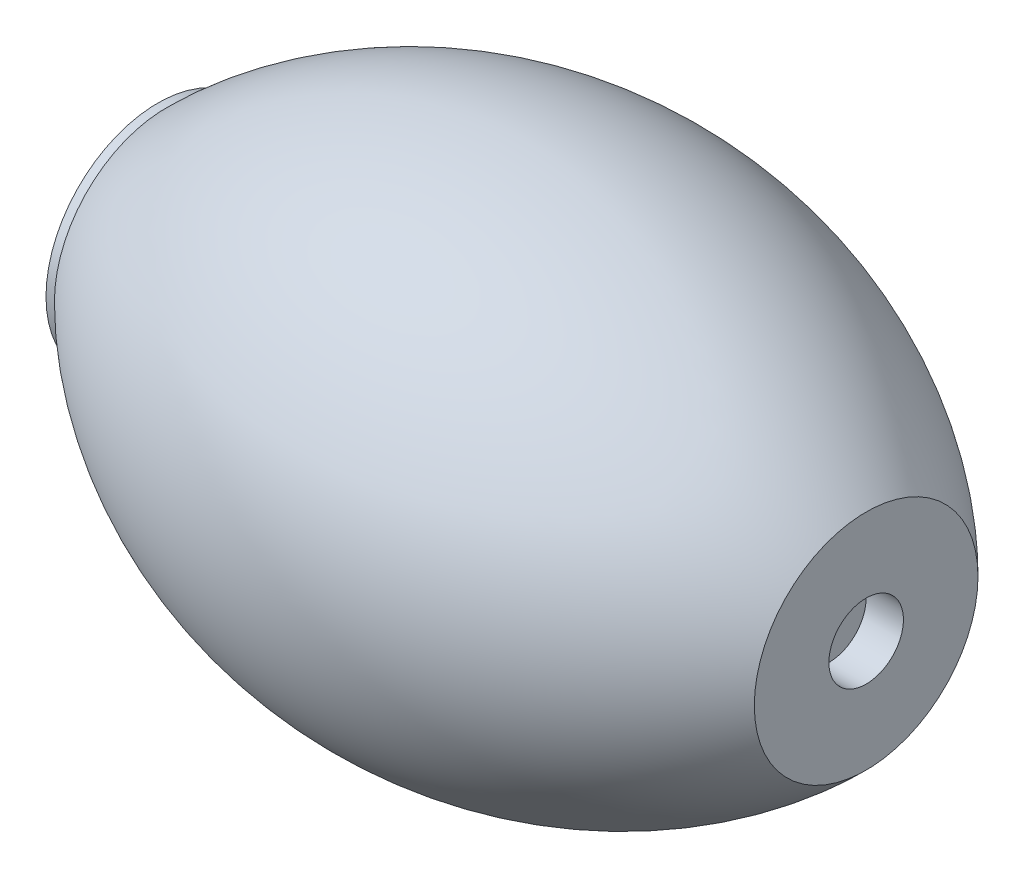
ISO-10303-21;
HEADER;
FILE_DESCRIPTION(('STEP AP214'),'2;1');
FILE_NAME('part.step','',(''),(''),'','','');
FILE_SCHEMA(('AUTOMOTIVE_DESIGN { 1 0 10303 214 1 1 1 1 }'));
ENDSEC;
DATA;
#1=APPLICATION_CONTEXT('core data for automotive mechanical design processes');
#2=APPLICATION_PROTOCOL_DEFINITION('international standard','automotive_design',2000,#1);
#3=PRODUCT_CONTEXT('',#1,'mechanical');
#4=PRODUCT('Part','Part','',(#3));
#5=PRODUCT_RELATED_PRODUCT_CATEGORY('part','',(#4));
#6=PRODUCT_DEFINITION_FORMATION('','',#4);
#7=PRODUCT_DEFINITION_CONTEXT('part definition',#1,'design');
#8=PRODUCT_DEFINITION('design','',#6,#7);
#9=PRODUCT_DEFINITION_SHAPE('','',#8);
#10=(LENGTH_UNIT() NAMED_UNIT(*) SI_UNIT(.MILLI.,.METRE.));
#11=(NAMED_UNIT(*) PLANE_ANGLE_UNIT() SI_UNIT($,.RADIAN.));
#12=(NAMED_UNIT(*) SI_UNIT($,.STERADIAN.) SOLID_ANGLE_UNIT());
#13=UNCERTAINTY_MEASURE_WITH_UNIT(LENGTH_MEASURE(1.E-05),#10,'distance_accuracy_value','');
#14=(GEOMETRIC_REPRESENTATION_CONTEXT(3) GLOBAL_UNCERTAINTY_ASSIGNED_CONTEXT((#13)) GLOBAL_UNIT_ASSIGNED_CONTEXT((#10,
#11,#12)) REPRESENTATION_CONTEXT('',''));
#15=CARTESIAN_POINT('',(0.,0.,0.));
#16=DIRECTION('',(0.,0.,1.));
#17=DIRECTION('',(1.,0.,0.));
#18=AXIS2_PLACEMENT_3D('',#15,#16,#17);
#19=CARTESIAN_POINT('',(-238.434509563249,-76.2,0.));
#20=DIRECTION('',(-1.,0.,0.));
#21=DIRECTION('',(0.,0.,1.));
#22=AXIS2_PLACEMENT_3D('',#19,#20,#21);
#23=DEGENERATE_TOROIDAL_SURFACE('',#22,162.234509563249,337.197317162125,.F.);
#24=CARTESIAN_POINT('',(-476.869019126499,-76.2000000000001,0.));
#25=DIRECTION('',(-1.,0.,0.));
#26=DIRECTION('',(0.,0.,1.));
#27=AXIS2_PLACEMENT_3D('',#24,#25,#26);
#28=CIRCLE('',#27,76.2);
#29=CARTESIAN_POINT('',(-476.869019126499,-76.2000000000001,76.2));
#30=VERTEX_POINT('',#29);
#31=EDGE_CURVE('E62',#30,#30,#28,.T.);
#32=ORIENTED_EDGE('',*,*,#31,.F.);
#33=EDGE_LOOP('',(#32));
#34=FACE_BOUND('',#33,.T.);
#35=CARTESIAN_POINT('',(0.,-76.2000000000001,0.));
#36=DIRECTION('',(-1.,0.,0.));
#37=DIRECTION('',(0.,0.,1.));
#38=AXIS2_PLACEMENT_3D('',#35,#36,#37);
#39=CIRCLE('',#38,76.2000000000001);
#40=CARTESIAN_POINT('',(0.,-76.2000000000001,76.2000000000001));
#41=VERTEX_POINT('',#40);
#42=EDGE_CURVE('E10',#41,#41,#39,.T.);
#43=ORIENTED_EDGE('',*,*,#42,.T.);
#44=EDGE_LOOP('',(#43));
#45=FACE_BOUND('',#44,.T.);
#46=ADVANCED_FACE('F37',(#34,#45),#23,.F.);
#47=CARTESIAN_POINT('',(0.,0.,0.));
#48=DIRECTION('',(-1.,0.,0.));
#49=DIRECTION('',(0.,0.,1.));
#50=AXIS2_PLACEMENT_3D('',#47,#48,#49);
#51=PLANE('',#50);
#52=ORIENTED_EDGE('',*,*,#42,.F.);
#53=EDGE_LOOP('',(#52));
#54=FACE_BOUND('',#53,.T.);
#55=CARTESIAN_POINT('',(1.11022302462516E-13,-76.2000000000001,0.));
#56=DIRECTION('',(-1.,0.,0.));
#57=DIRECTION('',(0.,0.,1.));
#58=AXIS2_PLACEMENT_3D('',#55,#56,#57);
#59=CIRCLE('',#58,25.4);
#60=CARTESIAN_POINT('',(1.11022302462516E-13,-76.2000000000001,25.4));
#61=VERTEX_POINT('',#60);
#62=EDGE_CURVE('E43',#61,#61,#59,.T.);
#63=ORIENTED_EDGE('',*,*,#62,.T.);
#64=EDGE_LOOP('',(#63));
#65=FACE_BOUND('',#64,.T.);
#66=ADVANCED_FACE('F69',(#54,#65),#51,.F.);
#67=CARTESIAN_POINT('',(-457.2,-76.2000000000001,0.));
#68=DIRECTION('',(-1.,0.,0.));
#69=DIRECTION('',(0.,0.,1.));
#70=AXIS2_PLACEMENT_3D('',#67,#68,#69);
#71=CYLINDRICAL_SURFACE('',#70,25.4);
#72=ORIENTED_EDGE('',*,*,#62,.F.);
#73=EDGE_LOOP('',(#72));
#74=FACE_BOUND('',#73,.T.);
#75=CARTESIAN_POINT('',(-25.3999999999999,-76.2000000000001,0.));
#76=DIRECTION('',(-1.,0.,0.));
#77=DIRECTION('',(0.,0.,1.));
#78=AXIS2_PLACEMENT_3D('',#75,#76,#77);
#79=CIRCLE('',#78,25.4);
#80=CARTESIAN_POINT('',(-25.3999999999999,-76.2000000000001,25.4));
#81=VERTEX_POINT('',#80);
#82=EDGE_CURVE('E47',#81,#81,#79,.T.);
#83=ORIENTED_EDGE('',*,*,#82,.T.);
#84=EDGE_LOOP('',(#83));
#85=FACE_BOUND('',#84,.T.);
#86=ADVANCED_FACE('F73',(#74,#85),#71,.F.);
#87=CARTESIAN_POINT('',(-25.3999999999999,-50.8000000000001,0.));
#88=DIRECTION('',(-1.,0.,0.));
#89=DIRECTION('',(0.,0.,1.));
#90=AXIS2_PLACEMENT_3D('',#87,#88,#89);
#91=PLANE('',#90);
#92=ORIENTED_EDGE('',*,*,#82,.F.);
#93=EDGE_LOOP('',(#92));
#94=FACE_BOUND('',#93,.T.);
#95=ADVANCED_FACE('F78',(#94),#91,.F.);
#96=CARTESIAN_POINT('',(-457.2,-50.8000000000001,0.));
#97=DIRECTION('',(1.,0.,0.));
#98=DIRECTION('',(0.,0.,-1.));
#99=AXIS2_PLACEMENT_3D('',#96,#97,#98);
#100=PLANE('',#99);
#101=CARTESIAN_POINT('',(-457.2,-76.2000000000001,0.));
#102=DIRECTION('',(-1.,0.,0.));
#103=DIRECTION('',(0.,0.,1.));
#104=AXIS2_PLACEMENT_3D('',#101,#102,#103);
#105=CIRCLE('',#104,25.4);
#106=CARTESIAN_POINT('',(-457.2,-76.2000000000001,25.4));
#107=VERTEX_POINT('',#106);
#108=EDGE_CURVE('E51',#107,#107,#105,.T.);
#109=ORIENTED_EDGE('',*,*,#108,.T.);
#110=EDGE_LOOP('',(#109));
#111=FACE_BOUND('',#110,.T.);
#112=ADVANCED_FACE('F84',(#111),#100,.F.);
#113=CARTESIAN_POINT('',(-457.2,-76.2000000000001,0.));
#114=DIRECTION('',(-1.,0.,0.));
#115=DIRECTION('',(0.,0.,1.));
#116=AXIS2_PLACEMENT_3D('',#113,#114,#115);
#117=CYLINDRICAL_SURFACE('',#116,25.4);
#118=ORIENTED_EDGE('',*,*,#108,.F.);
#119=EDGE_LOOP('',(#118));
#120=FACE_BOUND('',#119,.T.);
#121=CARTESIAN_POINT('',(-482.6,-76.2000000000001,0.));
#122=DIRECTION('',(-1.,0.,0.));
#123=DIRECTION('',(0.,0.,1.));
#124=AXIS2_PLACEMENT_3D('',#121,#122,#123);
#125=CIRCLE('',#124,25.4);
#126=CARTESIAN_POINT('',(-482.6,-76.2000000000001,25.4));
#127=VERTEX_POINT('',#126);
#128=EDGE_CURVE('E56',#127,#127,#125,.T.);
#129=ORIENTED_EDGE('',*,*,#128,.T.);
#130=EDGE_LOOP('',(#129));
#131=FACE_BOUND('',#130,.T.);
#132=ADVANCED_FACE('F88',(#120,#131),#117,.F.);
#133=CARTESIAN_POINT('',(-482.6,0.,0.));
#134=DIRECTION('',(1.,0.,0.));
#135=DIRECTION('',(0.,0.,-1.));
#136=AXIS2_PLACEMENT_3D('',#133,#134,#135);
#137=PLANE('',#136);
#138=ORIENTED_EDGE('',*,*,#128,.F.);
#139=EDGE_LOOP('',(#138));
#140=FACE_BOUND('',#139,.T.);
#141=CARTESIAN_POINT('',(-482.6,-76.2000000000001,0.));
#142=DIRECTION('',(-1.,0.,0.));
#143=DIRECTION('',(0.,0.,1.));
#144=AXIS2_PLACEMENT_3D('',#141,#142,#143);
#145=CIRCLE('',#144,76.2);
#146=CARTESIAN_POINT('',(-482.6,-76.2000000000001,76.2));
#147=VERTEX_POINT('',#146);
#148=EDGE_CURVE('E59',#147,#147,#145,.T.);
#149=ORIENTED_EDGE('',*,*,#148,.T.);
#150=EDGE_LOOP('',(#149));
#151=FACE_BOUND('',#150,.T.);
#152=ADVANCED_FACE('F92',(#140,#151),#137,.F.);
#153=CARTESIAN_POINT('',(-457.2,-76.2000000000001,0.));
#154=DIRECTION('',(-1.,0.,0.));
#155=DIRECTION('',(0.,0.,1.));
#156=AXIS2_PLACEMENT_3D('',#153,#154,#155);
#157=CYLINDRICAL_SURFACE('',#156,76.2);
#158=ORIENTED_EDGE('',*,*,#148,.F.);
#159=EDGE_LOOP('',(#158));
#160=FACE_BOUND('',#159,.T.);
#161=ORIENTED_EDGE('',*,*,#31,.T.);
#162=EDGE_LOOP('',(#161));
#163=FACE_BOUND('',#162,.T.);
#164=ADVANCED_FACE('F66',(#160,#163),#157,.T.);
#165=CLOSED_SHELL('',(#46,#66,#86,#95,#112,#132,#152,#164));
#166=MANIFOLD_SOLID_BREP('B2',#165);
#167=ADVANCED_BREP_SHAPE_REPRESENTATION('',(#18,#166),#14);
#168=SHAPE_DEFINITION_REPRESENTATION(#9,#167);
ENDSEC;
END-ISO-10303-21;
